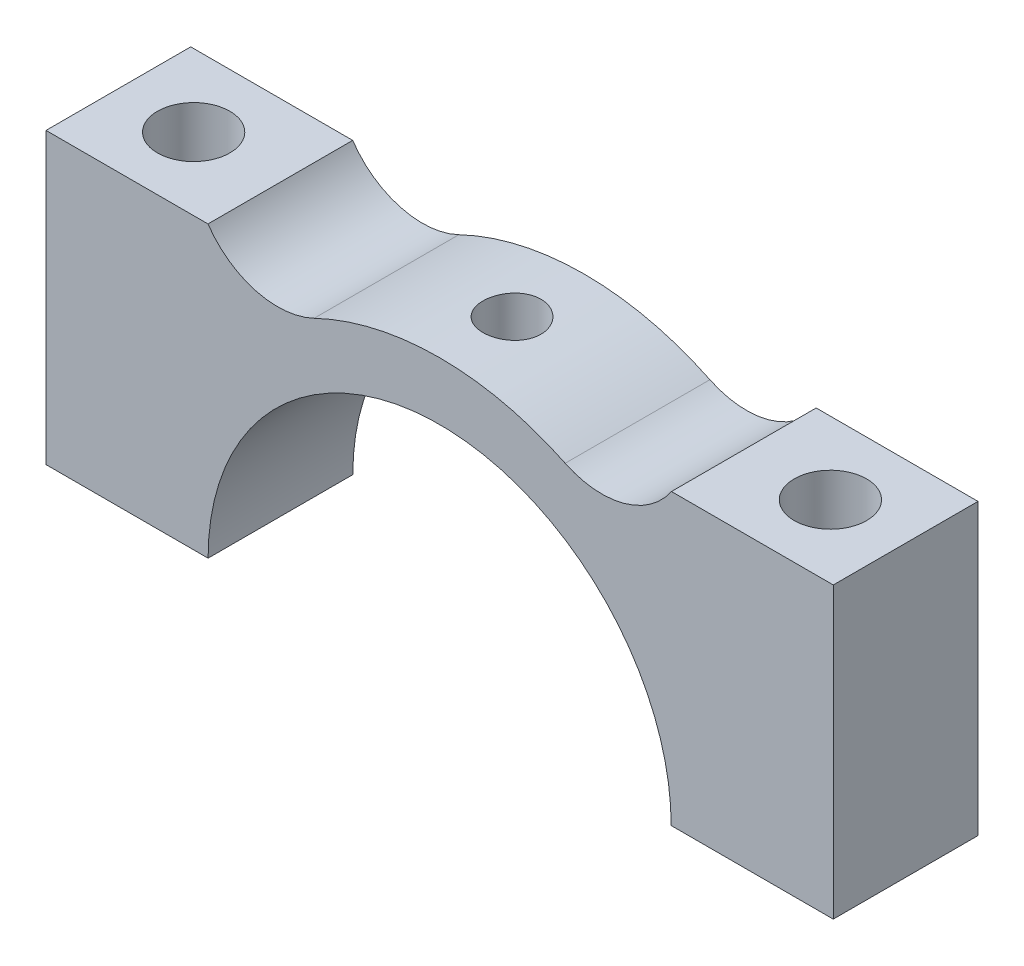
ISO-10303-21;
HEADER;
FILE_DESCRIPTION(('STEP AP214'),'2;1');
FILE_NAME('part.step','',(''),(''),'','','');
FILE_SCHEMA(('AUTOMOTIVE_DESIGN { 1 0 10303 214 1 1 1 1 }'));
ENDSEC;
DATA;
#1=APPLICATION_CONTEXT('core data for automotive mechanical design processes');
#2=APPLICATION_PROTOCOL_DEFINITION('international standard','automotive_design',2000,#1);
#3=PRODUCT_CONTEXT('',#1,'mechanical');
#4=PRODUCT('Part','Part','',(#3));
#5=PRODUCT_RELATED_PRODUCT_CATEGORY('part','',(#4));
#6=PRODUCT_DEFINITION_FORMATION('','',#4);
#7=PRODUCT_DEFINITION_CONTEXT('part definition',#1,'design');
#8=PRODUCT_DEFINITION('design','',#6,#7);
#9=PRODUCT_DEFINITION_SHAPE('','',#8);
#10=(LENGTH_UNIT() NAMED_UNIT(*) SI_UNIT(.MILLI.,.METRE.));
#11=(NAMED_UNIT(*) PLANE_ANGLE_UNIT() SI_UNIT($,.RADIAN.));
#12=(NAMED_UNIT(*) SI_UNIT($,.STERADIAN.) SOLID_ANGLE_UNIT());
#13=UNCERTAINTY_MEASURE_WITH_UNIT(LENGTH_MEASURE(1.E-05),#10,'distance_accuracy_value','');
#14=(GEOMETRIC_REPRESENTATION_CONTEXT(3) GLOBAL_UNCERTAINTY_ASSIGNED_CONTEXT((#13)) GLOBAL_UNIT_ASSIGNED_CONTEXT((#10,
#11,#12)) REPRESENTATION_CONTEXT('',''));
#15=CARTESIAN_POINT('',(0.,0.,0.));
#16=DIRECTION('',(0.,0.,1.));
#17=DIRECTION('',(1.,0.,0.));
#18=AXIS2_PLACEMENT_3D('',#15,#16,#17);
#19=CARTESIAN_POINT('',(0.,0.,5.));
#20=DIRECTION('',(0.,-1.,0.));
#21=DIRECTION('',(1.,0.,0.));
#22=AXIS2_PLACEMENT_3D('',#19,#20,#21);
#23=PLANE('',#22);
#24=CARTESIAN_POINT('',(-10.9989308914531,0.,2.49999999999886));
#25=DIRECTION('',(0.,1.,0.));
#26=DIRECTION('',(0.,0.,1.));
#27=AXIS2_PLACEMENT_3D('',#24,#25,#26);
#28=CIRCLE('',#27,1.25);
#29=CARTESIAN_POINT('',(-10.9989308914531,0.,3.74999999999886));
#30=VERTEX_POINT('',#29);
#31=EDGE_CURVE('E253',#30,#30,#28,.T.);
#32=ORIENTED_EDGE('',*,*,#31,.T.);
#33=EDGE_LOOP('',(#32));
#34=FACE_BOUND('',#33,.T.);
#35=DIRECTION('',(-1.,0.,0.));
#36=VECTOR('',#35,1.);
#37=CARTESIAN_POINT('',(0.,0.,0.));
#38=LINE('',#37,#36);
#39=CARTESIAN_POINT('',(-8.,0.,0.));
#40=VERTEX_POINT('',#39);
#41=CARTESIAN_POINT('',(-13.6,0.,0.));
#42=VERTEX_POINT('',#41);
#43=EDGE_CURVE('E169',#40,#42,#38,.T.);
#44=ORIENTED_EDGE('',*,*,#43,.F.);
#45=DIRECTION('',(0.,0.,-1.));
#46=VECTOR('',#45,1.);
#47=CARTESIAN_POINT('',(-8.,0.,5.));
#48=LINE('',#47,#46);
#49=CARTESIAN_POINT('',(-8.,0.,5.));
#50=VERTEX_POINT('',#49);
#51=EDGE_CURVE('E66',#50,#40,#48,.T.);
#52=ORIENTED_EDGE('',*,*,#51,.F.);
#53=DIRECTION('',(-1.,0.,0.));
#54=VECTOR('',#53,1.);
#55=CARTESIAN_POINT('',(0.,0.,5.));
#56=LINE('',#55,#54);
#57=CARTESIAN_POINT('',(-13.6,0.,5.));
#58=VERTEX_POINT('',#57);
#59=EDGE_CURVE('E191',#50,#58,#56,.T.);
#60=ORIENTED_EDGE('',*,*,#59,.T.);
#61=DIRECTION('',(0.,0.,-1.));
#62=VECTOR('',#61,1.);
#63=CARTESIAN_POINT('',(-13.6,0.,5.));
#64=LINE('',#63,#62);
#65=EDGE_CURVE('E74',#58,#42,#64,.T.);
#66=ORIENTED_EDGE('',*,*,#65,.T.);
#67=EDGE_LOOP('',(#44,#52,#60,#66));
#68=FACE_BOUND('',#67,.T.);
#69=ADVANCED_FACE('F53',(#34,#68),#23,.T.);
#70=CARTESIAN_POINT('',(0.,0.,5.));
#71=DIRECTION('',(0.,0.,-1.));
#72=DIRECTION('',(-1.,0.,0.));
#73=AXIS2_PLACEMENT_3D('',#70,#71,#72);
#74=CYLINDRICAL_SURFACE('',#73,8.);
#75=CARTESIAN_POINT('',(0.,8.,3.49999999999884));
#76=CARTESIAN_POINT('',(-0.0559364382223045,7.99999921958571,3.49999762362455));
#77=CARTESIAN_POINT('',(-0.111907829721099,7.99940713821961,3.49529084833112));
#78=CARTESIAN_POINT('',(-0.222293120835901,7.99710216044544,3.47658889817052));
#79=CARTESIAN_POINT('',(-0.276705332249498,7.99538809376571,3.46258402482948));
#80=CARTESIAN_POINT('',(-0.382358229925221,7.99103224417762,3.4257049424332));
#81=CARTESIAN_POINT('',(-0.433601024058455,7.98839108582217,3.40283670327489));
#82=CARTESIAN_POINT('',(-0.531511789957214,7.98247480351239,3.34889308641092));
#83=CARTESIAN_POINT('',(-0.578180544622548,7.97919978833646,3.31781911658655));
#84=CARTESIAN_POINT('',(-0.665885126772526,7.9723612852253,3.248163220063));
#85=CARTESIAN_POINT('',(-0.70689214597485,7.96879645876967,3.20954514826034));
#86=CARTESIAN_POINT('',(-0.781861117422997,7.961790904039,3.12597487058418));
#87=CARTESIAN_POINT('',(-0.8158227105569,7.95835018209707,3.08102234203354));
#88=CARTESIAN_POINT('',(-0.875844064513575,7.95196922247834,2.98587200897257));
#89=CARTESIAN_POINT('',(-0.901876838376428,7.94903070871164,2.93565705537166));
#90=CARTESIAN_POINT('',(-0.945129230630046,7.94400451383073,2.83152517921989));
#91=CARTESIAN_POINT('',(-0.962349183226086,7.94191680045254,2.77760839714003));
#92=CARTESIAN_POINT('',(-0.987399592009905,7.93884135841445,2.66790232176413));
#93=CARTESIAN_POINT('',(-0.99527868589268,7.93784793374698,2.61212429691716));
#94=CARTESIAN_POINT('',(-1.00157421982289,7.93705611257117,2.5000294946101));
#95=CARTESIAN_POINT('',(-0.999991040400967,7.93725766800603,2.44371273890632));
#96=CARTESIAN_POINT('',(-0.987446894579162,7.93882782147901,2.33247806909932));
#97=CARTESIAN_POINT('',(-0.976539505193879,7.94018975184131,2.27755400551873));
#98=CARTESIAN_POINT('',(-0.945740153272821,7.94391679903051,2.17032199151124));
#99=CARTESIAN_POINT('',(-0.925848008700761,7.94628193618289,2.11801409411322));
#100=CARTESIAN_POINT('',(-0.87758622396466,7.9517564634586,2.01733280039016));
#101=CARTESIAN_POINT('',(-0.849193301483055,7.95486789284578,1.96897067989924));
#102=CARTESIAN_POINT('',(-0.784752587782768,7.96148284572239,1.87767732223354));
#103=CARTESIAN_POINT('',(-0.748704446432311,7.96498638714265,1.83474633360936));
#104=CARTESIAN_POINT('',(-0.669679644301512,7.9720204395617,1.75522291570974));
#105=CARTESIAN_POINT('',(-0.626656803136005,7.97555096954756,1.71867636329244));
#106=CARTESIAN_POINT('',(-0.53506286764557,7.98221853022341,1.65331644798662));
#107=CARTESIAN_POINT('',(-0.486491760527301,7.98535556000602,1.62450310293004));
#108=CARTESIAN_POINT('',(-0.385144668545393,7.99088460887432,1.57542747181327));
#109=CARTESIAN_POINT('',(-0.332367278135087,7.99327637760615,1.55516805844635));
#110=CARTESIAN_POINT('',(-0.224123176172423,7.99704314312025,1.52381180258954));
#111=CARTESIAN_POINT('',(-0.168656590652267,7.99841818750348,1.51271453114402));
#112=CARTESIAN_POINT('',(-0.0570052655653994,7.99999038564304,1.50005703029462));
#113=CARTESIAN_POINT('',(-0.000827796079443296,8.00019534457054,1.49843360305321));
#114=CARTESIAN_POINT('',(0.110998414598998,7.99942535202172,1.50460309362122));
#115=CARTESIAN_POINT('',(0.166647167025882,7.99845042567285,1.51239581089947));
#116=CARTESIAN_POINT('',(0.275649803088608,7.99543507502677,1.53712388350859));
#117=CARTESIAN_POINT('',(0.329010628169881,7.99339816325548,1.55402910535989));
#118=CARTESIAN_POINT('',(0.432139861943362,7.98848689240079,1.596470980764));
#119=CARTESIAN_POINT('',(0.481908148586125,7.98561250488249,1.62200792739541));
#120=CARTESIAN_POINT('',(0.57672180827497,7.97932729164045,1.68114125500182));
#121=CARTESIAN_POINT('',(0.621741503977527,7.97591377617004,1.71477851592109));
#122=CARTESIAN_POINT('',(0.705518795850527,7.96894056930262,1.78909979901252));
#123=CARTESIAN_POINT('',(0.744276143334743,7.96538087210759,1.82978410089923));
#124=CARTESIAN_POINT('',(0.814652783527206,7.95849242185034,1.91732296670169));
#125=CARTESIAN_POINT('',(0.846230184227173,7.9551650988853,1.96421133852299));
#126=CARTESIAN_POINT('',(0.901061155777402,7.94914164414859,2.06266329794072));
#127=CARTESIAN_POINT('',(0.924314893491347,7.94644549972411,2.11422679178944));
#128=CARTESIAN_POINT('',(0.961770631546616,7.94199940157198,2.22043012765788));
#129=CARTESIAN_POINT('',(0.975996250982843,7.94024698073915,2.27506153201802));
#130=CARTESIAN_POINT('',(0.995067997547138,7.93787966362982,2.3859609935111));
#131=CARTESIAN_POINT('',(0.999914561014305,7.93726471443511,2.44222897438244));
#132=CARTESIAN_POINT('',(1.00008261443393,7.93724350792982,2.55438757168071));
#133=CARTESIAN_POINT('',(0.99546991907971,7.93782889900781,2.61027809933159));
#134=CARTESIAN_POINT('',(0.976989761939731,7.94012445814881,2.72048285173687));
#135=CARTESIAN_POINT('',(0.963122299162308,7.94183462633232,2.77479707632235));
#136=CARTESIAN_POINT('',(0.926546829475863,7.9461844630982,2.88029878270539));
#137=CARTESIAN_POINT('',(0.903841992388374,7.94882379837113,2.93148737800756));
#138=CARTESIAN_POINT('',(0.850242760860124,7.95473513297927,3.02933866161816));
#139=CARTESIAN_POINT('',(0.819348263803836,7.95800714024165,3.07600129320677));
#140=CARTESIAN_POINT('',(0.750002532506336,7.96484241900893,3.16381249013503));
#141=CARTESIAN_POINT('',(0.711502250309984,7.96840748833613,3.20492218438083));
#142=CARTESIAN_POINT('',(0.628140090787354,7.9754113263716,3.28012273006602));
#143=CARTESIAN_POINT('',(0.583276715656628,7.97885006510236,3.31421192430856));
#144=CARTESIAN_POINT('',(0.488266248341685,7.98522822634699,3.37451414284095));
#145=CARTESIAN_POINT('',(0.438099711838469,7.9881657003132,3.40069672235854));
#146=CARTESIAN_POINT('',(0.334073160920513,7.9931905963069,3.44422849716535));
#147=CARTESIAN_POINT('',(0.280217232348095,7.9952789414783,3.46158729054022));
#148=CARTESIAN_POINT('',(0.188402308787171,7.99786688131099,3.48282373526736));
#149=CARTESIAN_POINT('',(0.151022265406769,7.99866290358181,3.48925557679166));
#150=CARTESIAN_POINT('',(0.0757668252849745,7.99972972531675,3.49784449827613));
#151=CARTESIAN_POINT('',(0.0378914321984112,8.00000052865388,3.50000160975856));
#152=CARTESIAN_POINT('',(0.,8.,3.49999999999884));
#153=B_SPLINE_CURVE_WITH_KNOTS('',3,(#75,#76,#77,#78,#79,#80,#81,#82,#83,#84,#85,#86,#87,#88,
#89,#90,#91,#92,#93,#94,#95,#96,#97,#98,#99,#100,#101,#102,#103,#104,#105,#106,#107,#108,#109,
#110,#111,#112,#113,#114,#115,#116,#117,#118,#119,#120,#121,#122,#123,#124,#125,#126,#127,#128,
#129,#130,#131,#132,#133,#134,#135,#136,#137,#138,#139,#140,#141,#142,#143,#144,#145,#146,#147,
#148,#149,#150,#151,#152),.UNSPECIFIED.,.T.,.F.,(4,2,2,2,2,2,2,2,2,2,2,2,2,2,2,2,2,2,2,2,2,2,2,
2,2,2,2,2,2,2,2,2,2,2,2,2,2,2,4),(0.,0.167670909110499,0.335516984377371,0.503250203272708,
0.670954662364292,0.839483252807372,1.00802043120004,1.17712500127548,1.34622315798723,
1.51443690114528,1.68264387953865,1.84989078576677,2.01714108066496,2.18485370514213,
2.35257400205455,2.52145391254567,2.69033421245245,2.85927118292642,3.02820024361512,
3.19600111756768,3.36379841800771,3.53104421557358,3.69829569231579,3.86640961171369,
4.03453020550035,4.20360788603029,4.37268217688615,4.5413122971237,4.70993457204249,
4.87738760480886,5.04484065551819,5.21223369882595,5.37962883964905,5.54814095076732,
5.71669279388005,5.88588561214741,6.05489399473613,6.16847537275051,6.28205591320175),.UNSPECIFIED.);
#154=CARTESIAN_POINT('',(0.,8.,3.49999999999884));
#155=VERTEX_POINT('',#154);
#156=EDGE_CURVE('E265',#155,#155,#153,.T.);
#157=ORIENTED_EDGE('',*,*,#156,.F.);
#158=EDGE_LOOP('',(#157));
#159=FACE_BOUND('',#158,.T.);
#160=CARTESIAN_POINT('',(0.,0.,0.));
#161=DIRECTION('',(0.,0.,1.));
#162=DIRECTION('',(1.,0.,0.));
#163=AXIS2_PLACEMENT_3D('',#160,#161,#162);
#164=CIRCLE('',#163,8.);
#165=CARTESIAN_POINT('',(8.,0.,0.));
#166=VERTEX_POINT('',#165);
#167=EDGE_CURVE('E172',#166,#40,#164,.T.);
#168=ORIENTED_EDGE('',*,*,#167,.F.);
#169=DIRECTION('',(0.,0.,-1.));
#170=VECTOR('',#169,1.);
#171=CARTESIAN_POINT('',(8.,0.,5.));
#172=LINE('',#171,#170);
#173=CARTESIAN_POINT('',(8.,0.,5.));
#174=VERTEX_POINT('',#173);
#175=EDGE_CURVE('E336',#174,#166,#172,.T.);
#176=ORIENTED_EDGE('',*,*,#175,.F.);
#177=CARTESIAN_POINT('',(0.,0.,5.));
#178=DIRECTION('',(0.,0.,1.));
#179=DIRECTION('',(1.,0.,0.));
#180=AXIS2_PLACEMENT_3D('',#177,#178,#179);
#181=CIRCLE('',#180,8.);
#182=EDGE_CURVE('E184',#174,#50,#181,.T.);
#183=ORIENTED_EDGE('',*,*,#182,.T.);
#184=ORIENTED_EDGE('',*,*,#51,.T.);
#185=EDGE_LOOP('',(#168,#176,#183,#184));
#186=FACE_BOUND('',#185,.T.);
#187=ADVANCED_FACE('F274',(#159,#186),#74,.F.);
#188=CARTESIAN_POINT('',(0.,0.,5.));
#189=DIRECTION('',(0.,1.,0.));
#190=DIRECTION('',(0.,0.,1.));
#191=AXIS2_PLACEMENT_3D('',#188,#189,#190);
#192=PLANE('',#191);
#193=CARTESIAN_POINT('',(11.0010691085469,0.,2.49999999999884));
#194=DIRECTION('',(0.,1.,0.));
#195=DIRECTION('',(0.,0.,1.));
#196=AXIS2_PLACEMENT_3D('',#193,#194,#195);
#197=CIRCLE('',#196,1.25);
#198=CARTESIAN_POINT('',(11.0010691085469,0.,3.74999999999884));
#199=VERTEX_POINT('',#198);
#200=EDGE_CURVE('E262',#199,#199,#197,.T.);
#201=ORIENTED_EDGE('',*,*,#200,.T.);
#202=EDGE_LOOP('',(#201));
#203=FACE_BOUND('',#202,.T.);
#204=DIRECTION('',(1.,0.,0.));
#205=VECTOR('',#204,1.);
#206=CARTESIAN_POINT('',(0.,0.,0.));
#207=LINE('',#206,#205);
#208=CARTESIAN_POINT('',(13.6,0.,0.));
#209=VERTEX_POINT('',#208);
#210=EDGE_CURVE('E178',#166,#209,#207,.T.);
#211=ORIENTED_EDGE('',*,*,#210,.T.);
#212=DIRECTION('',(0.,0.,-1.));
#213=VECTOR('',#212,1.);
#214=CARTESIAN_POINT('',(13.6,0.,5.));
#215=LINE('',#214,#213);
#216=CARTESIAN_POINT('',(13.6,0.,5.));
#217=VERTEX_POINT('',#216);
#218=EDGE_CURVE('E343',#217,#209,#215,.T.);
#219=ORIENTED_EDGE('',*,*,#218,.F.);
#220=DIRECTION('',(1.,0.,0.));
#221=VECTOR('',#220,1.);
#222=CARTESIAN_POINT('',(0.,0.,5.));
#223=LINE('',#222,#221);
#224=EDGE_CURVE('E190',#174,#217,#223,.T.);
#225=ORIENTED_EDGE('',*,*,#224,.F.);
#226=ORIENTED_EDGE('',*,*,#175,.T.);
#227=EDGE_LOOP('',(#211,#219,#225,#226));
#228=FACE_BOUND('',#227,.T.);
#229=ADVANCED_FACE('F319',(#203,#228),#192,.F.);
#230=CARTESIAN_POINT('',(13.6,0.,5.));
#231=DIRECTION('',(-1.,0.,0.));
#232=DIRECTION('',(0.,0.,1.));
#233=AXIS2_PLACEMENT_3D('',#230,#231,#232);
#234=PLANE('',#233);
#235=DIRECTION('',(0.,1.,0.));
#236=VECTOR('',#235,1.);
#237=CARTESIAN_POINT('',(13.6,0.,0.));
#238=LINE('',#237,#236);
#239=CARTESIAN_POINT('',(13.6,10.,0.));
#240=VERTEX_POINT('',#239);
#241=EDGE_CURVE('E242',#209,#240,#238,.T.);
#242=ORIENTED_EDGE('',*,*,#241,.T.);
#243=DIRECTION('',(0.,0.,-1.));
#244=VECTOR('',#243,1.);
#245=CARTESIAN_POINT('',(13.6,10.,5.));
#246=LINE('',#245,#244);
#247=CARTESIAN_POINT('',(13.6,10.,5.));
#248=VERTEX_POINT('',#247);
#249=EDGE_CURVE('E349',#248,#240,#246,.T.);
#250=ORIENTED_EDGE('',*,*,#249,.F.);
#251=DIRECTION('',(0.,1.,0.));
#252=VECTOR('',#251,1.);
#253=CARTESIAN_POINT('',(13.6,0.,5.));
#254=LINE('',#253,#252);
#255=EDGE_CURVE('E196',#217,#248,#254,.T.);
#256=ORIENTED_EDGE('',*,*,#255,.F.);
#257=ORIENTED_EDGE('',*,*,#218,.T.);
#258=EDGE_LOOP('',(#242,#250,#256,#257));
#259=FACE_BOUND('',#258,.T.);
#260=ADVANCED_FACE('F316',(#259),#234,.F.);
#261=CARTESIAN_POINT('',(0.,10.,5.));
#262=DIRECTION('',(0.,-1.,0.));
#263=DIRECTION('',(0.,0.,-1.));
#264=AXIS2_PLACEMENT_3D('',#261,#262,#263);
#265=PLANE('',#264);
#266=CARTESIAN_POINT('',(11.0010691085469,10.,2.49999999999884));
#267=DIRECTION('',(0.,-1.,0.));
#268=DIRECTION('',(0.,0.,-1.));
#269=AXIS2_PLACEMENT_3D('',#266,#267,#268);
#270=CIRCLE('',#269,1.25);
#271=CARTESIAN_POINT('',(11.0010691085469,10.,1.24999999999884));
#272=VERTEX_POINT('',#271);
#273=EDGE_CURVE('E258',#272,#272,#270,.F.);
#274=ORIENTED_EDGE('',*,*,#273,.F.);
#275=EDGE_LOOP('',(#274));
#276=FACE_BOUND('',#275,.T.);
#277=DIRECTION('',(-1.,0.,0.));
#278=VECTOR('',#277,1.);
#279=CARTESIAN_POINT('',(0.,10.,0.));
#280=LINE('',#279,#278);
#281=CARTESIAN_POINT('',(8.00887124572743,10.,0.));
#282=VERTEX_POINT('',#281);
#283=EDGE_CURVE('E237',#240,#282,#280,.T.);
#284=ORIENTED_EDGE('',*,*,#283,.T.);
#285=DIRECTION('',(0.,0.,-1.));
#286=VECTOR('',#285,1.);
#287=CARTESIAN_POINT('',(8.00887124572743,10.,5.));
#288=LINE('',#287,#286);
#289=CARTESIAN_POINT('',(8.00887124572743,10.,5.));
#290=VERTEX_POINT('',#289);
#291=EDGE_CURVE('E353',#290,#282,#288,.T.);
#292=ORIENTED_EDGE('',*,*,#291,.F.);
#293=DIRECTION('',(-1.,0.,0.));
#294=VECTOR('',#293,1.);
#295=CARTESIAN_POINT('',(0.,10.,5.));
#296=LINE('',#295,#294);
#297=EDGE_CURVE('E199',#248,#290,#296,.T.);
#298=ORIENTED_EDGE('',*,*,#297,.F.);
#299=ORIENTED_EDGE('',*,*,#249,.T.);
#300=EDGE_LOOP('',(#284,#292,#298,#299));
#301=FACE_BOUND('',#300,.T.);
#302=ADVANCED_FACE('F312',(#276,#301),#265,.F.);
#303=CARTESIAN_POINT('',(5.59999999999348,11.6315143932289,5.));
#304=DIRECTION('',(0.,0.,-1.));
#305=DIRECTION('',(-1.,0.,0.));
#306=AXIS2_PLACEMENT_3D('',#303,#304,#305);
#307=CYLINDRICAL_SURFACE('',#306,2.9093813592991);
#308=CARTESIAN_POINT('',(5.59999999999348,11.6315143932289,0.));
#309=DIRECTION('',(0.,0.,1.));
#310=DIRECTION('',(1.,0.,0.));
#311=AXIS2_PLACEMENT_3D('',#308,#309,#310);
#312=CIRCLE('',#311,2.9093813592991);
#313=CARTESIAN_POINT('',(4.33793056702875,9.01012532630027,0.));
#314=VERTEX_POINT('',#313);
#315=EDGE_CURVE('E232',#314,#282,#312,.T.);
#316=ORIENTED_EDGE('',*,*,#315,.F.);
#317=DIRECTION('',(0.,0.,-1.));
#318=VECTOR('',#317,1.);
#319=CARTESIAN_POINT('',(4.33793056702875,9.01012532630027,5.));
#320=LINE('',#319,#318);
#321=CARTESIAN_POINT('',(4.33793056702875,9.01012532630027,5.));
#322=VERTEX_POINT('',#321);
#323=EDGE_CURVE('E356',#322,#314,#320,.T.);
#324=ORIENTED_EDGE('',*,*,#323,.F.);
#325=CARTESIAN_POINT('',(5.59999999999348,11.6315143932289,5.));
#326=DIRECTION('',(0.,0.,1.));
#327=DIRECTION('',(1.,0.,0.));
#328=AXIS2_PLACEMENT_3D('',#325,#326,#327);
#329=CIRCLE('',#328,2.9093813592991);
#330=EDGE_CURVE('E202',#322,#290,#329,.T.);
#331=ORIENTED_EDGE('',*,*,#330,.T.);
#332=ORIENTED_EDGE('',*,*,#291,.T.);
#333=EDGE_LOOP('',(#316,#324,#331,#332));
#334=FACE_BOUND('',#333,.T.);
#335=ADVANCED_FACE('F308',(#334),#307,.F.);
#336=CARTESIAN_POINT('',(0.,0.,5.));
#337=DIRECTION('',(0.,0.,-1.));
#338=DIRECTION('',(-1.,0.,0.));
#339=AXIS2_PLACEMENT_3D('',#336,#337,#338);
#340=CYLINDRICAL_SURFACE('',#339,10.);
#341=CARTESIAN_POINT('',(0.,10.,3.49999999999884));
#342=CARTESIAN_POINT('',(-0.0560203537915572,9.9999993552077,3.49999757409846));
#343=CARTESIAN_POINT('',(-0.112077745167773,9.99952425596206,3.49527673110239));
#344=CARTESIAN_POINT('',(-0.222638398496837,9.99767467594738,3.47651562970841));
#345=CARTESIAN_POINT('',(-0.277139879168828,9.99629920434026,3.46246510397425));
#346=CARTESIAN_POINT('',(-0.382971675453414,9.9928041456307,3.425457759401));
#347=CARTESIAN_POINT('',(-0.43430388461491,9.99068500800708,3.40250631948036));
#348=CARTESIAN_POINT('',(-0.532376160960407,9.98593957394306,3.34835909206719));
#349=CARTESIAN_POINT('',(-0.579117138779077,9.98331337838132,3.3171649439987));
#350=CARTESIAN_POINT('',(-0.666859550674082,9.97783744341324,3.24729730233656));
#351=CARTESIAN_POINT('',(-0.707842144834892,9.97498701573866,3.2086002005968));
#352=CARTESIAN_POINT('',(-0.782742521430984,9.96938956906262,3.12487546573581));
#353=CARTESIAN_POINT('',(-0.816659977082653,9.96664255484917,3.07984753995645));
#354=CARTESIAN_POINT('',(-0.876533970443617,9.96155591552784,2.98462146831522));
#355=CARTESIAN_POINT('',(-0.902473465454879,9.95921716710905,2.93441255590398));
#356=CARTESIAN_POINT('',(-0.94554638474276,9.95522037546525,2.83032441409386));
#357=CARTESIAN_POINT('',(-0.962680026591291,9.95356231542222,2.77644527541489));
#358=CARTESIAN_POINT('',(-0.987599041601894,9.95112084072978,2.66673819913283));
#359=CARTESIAN_POINT('',(-0.995415653003795,9.95033450398096,2.61091742314663));
#360=CARTESIAN_POINT('',(-1.00157528513536,9.94971643060525,2.49875113660306));
#361=CARTESIAN_POINT('',(-0.999918554870801,9.94988466888746,2.44240563987678));
#362=CARTESIAN_POINT('',(-0.987204280252678,9.95115406898935,2.33100469030552));
#363=CARTESIAN_POINT('',(-0.976180844124552,9.95225184590651,2.27594530067014));
#364=CARTESIAN_POINT('',(-0.945099144150586,9.95525134287419,2.16846203679774));
#365=CARTESIAN_POINT('',(-0.925040758255746,9.95715307378492,2.1160381981738));
#366=CARTESIAN_POINT('',(-0.876420893881507,9.9615500945207,2.01520641269995));
#367=CARTESIAN_POINT('',(-0.847844282719979,9.96404643908157,1.96680581050952));
#368=CARTESIAN_POINT('',(-0.783010027353227,9.96935051732879,1.87547478508695));
#369=CARTESIAN_POINT('',(-0.746752158336505,9.97215826012784,1.83254452201707));
#370=CARTESIAN_POINT('',(-0.667394112412069,9.97778385312989,1.75317460600981));
#371=CARTESIAN_POINT('',(-0.624264478851363,9.98060169332997,1.71676439811803));
#372=CARTESIAN_POINT('',(-0.532489481737112,9.98591829078518,1.65169636708845));
#373=CARTESIAN_POINT('',(-0.4838441119996,9.98841704768256,1.62303855264236));
#374=CARTESIAN_POINT('',(-0.382398105692364,9.99281475667096,1.57428997968858));
#375=CARTESIAN_POINT('',(-0.329596746389902,9.99471360414769,1.55420071518077));
#376=CARTESIAN_POINT('',(-0.221347217329931,9.99769647441408,1.52318108328708));
#377=CARTESIAN_POINT('',(-0.1658991267766,9.99878052157063,1.51225044200821));
#378=CARTESIAN_POINT('',(-0.0541850990919032,10.0000085166831,1.49989569226407));
#379=CARTESIAN_POINT('',(0.00207630210549248,10.0001564826774,1.49843095174634));
#380=CARTESIAN_POINT('',(0.1140437933157,9.99950641756797,1.5049428630476));
#381=CARTESIAN_POINT('',(0.169749890820471,9.99870839924468,1.51291938731412));
#382=CARTESIAN_POINT('',(0.278908206834675,9.99625861539194,1.53805369542041));
#383=CARTESIAN_POINT('',(0.33236484897202,9.99460861918039,1.55519245447685));
#384=CARTESIAN_POINT('',(0.435644321383782,9.99063998860609,1.59814517403611));
#385=CARTESIAN_POINT('',(0.485467070157118,9.98832133925254,1.62395932903823));
#386=CARTESIAN_POINT('',(0.580248180172143,9.98326475330422,1.68363083866275));
#387=CARTESIAN_POINT('',(0.625189659748918,9.98052543603441,1.71751488892465));
#388=CARTESIAN_POINT('',(0.708761623311878,9.9749393286952,1.79232606773976));
#389=CARTESIAN_POINT('',(0.747391948849177,9.97209253592971,1.83325337306915));
#390=CARTESIAN_POINT('',(0.817386109887146,9.96660024140755,1.92116657465784));
#391=CARTESIAN_POINT('',(0.848723278679544,9.96395550138975,1.96817375654146));
#392=CARTESIAN_POINT('',(0.903058258743828,9.9591783246089,2.06680736014552));
#393=CARTESIAN_POINT('',(0.926056184053882,9.95704588084038,2.11843371868723));
#394=CARTESIAN_POINT('',(0.963015208684475,9.95353947634049,2.22474873946463));
#395=CARTESIAN_POINT('',(0.976992174811862,9.95216418449789,2.27943184008996));
#396=CARTESIAN_POINT('',(0.995564007129463,9.95032365282877,2.39038319795961));
#397=CARTESIAN_POINT('',(1.00015914239952,9.94985838690186,2.44665140969451));
#398=CARTESIAN_POINT('',(0.999833138471256,9.94989113107562,2.55891068835554));
#399=CARTESIAN_POINT('',(0.994953889593112,9.95038490087009,2.61490188288165));
#400=CARTESIAN_POINT('',(0.975905452963653,9.95227103889546,2.72526491716713));
#401=CARTESIAN_POINT('',(0.961736254762159,9.95366340813718,2.77963675510482));
#402=CARTESIAN_POINT('',(0.924521686297503,9.95718868263187,2.88521734904669));
#403=CARTESIAN_POINT('',(0.901477544340915,9.95932148540361,2.93642654162856));
#404=CARTESIAN_POINT('',(0.847171554911043,9.96408751839359,3.03425689166987));
#405=CARTESIAN_POINT('',(0.815909753455414,9.96672074580951,3.08087807481947));
#406=CARTESIAN_POINT('',(0.745898556285331,9.97220487209698,3.16842367447077));
#407=CARTESIAN_POINT('',(0.707117948890268,9.97505664726751,3.20932307636592));
#408=CARTESIAN_POINT('',(0.623231699225109,9.98064854728783,3.28405223269849));
#409=CARTESIAN_POINT('',(0.578124544108256,9.98338864522976,3.31788029135601));
#410=CARTESIAN_POINT('',(0.482741434161289,9.98845562069162,3.37757345385346));
#411=CARTESIAN_POINT('',(0.432452749346763,9.99078144026812,3.40341829094402));
#412=CARTESIAN_POINT('',(0.32825827910055,9.99474629249896,3.4462624228227));
#413=CARTESIAN_POINT('',(0.274356649825609,9.99638609909654,3.46327169095238));
#414=CARTESIAN_POINT('',(0.183458261405704,9.99838213773734,3.48372061708364));
#415=CARTESIAN_POINT('',(0.147042552844508,9.99898600691833,3.48981704429819));
#416=CARTESIAN_POINT('',(0.0737565808173126,9.99979514950786,3.4979575260606));
#417=CARTESIAN_POINT('',(0.0368863192265576,10.0000004245602,3.5000015973207));
#418=CARTESIAN_POINT('',(0.,10.,3.49999999999884));
#419=B_SPLINE_CURVE_WITH_KNOTS('',3,(#341,#342,#343,#344,#345,#346,#347,#348,#349,#350,#351,
#352,#353,#354,#355,#356,#357,#358,#359,#360,#361,#362,#363,#364,#365,#366,#367,#368,#369,#370,
#371,#372,#373,#374,#375,#376,#377,#378,#379,#380,#381,#382,#383,#384,#385,#386,#387,#388,#389,
#390,#391,#392,#393,#394,#395,#396,#397,#398,#399,#400,#401,#402,#403,#404,#405,#406,#407,#408,
#409,#410,#411,#412,#413,#414,#415,#416,#417,#418),.UNSPECIFIED.,.T.,.F.,(4,2,2,2,2,2,2,2,2,2,2,
2,2,2,2,2,2,2,2,2,2,2,2,2,2,2,2,2,2,2,2,2,2,2,2,2,2,2,4),(0.,0.167926366268474,
0.336037842835486,0.504047885732202,0.672024537582782,0.840538568622945,1.00906039220706,
1.17793975472222,1.34681494442504,1.51512232045197,1.68342527255777,1.8511179744111,
2.01881294161634,2.18680761372895,2.35480720331125,2.52354734196207,2.69228766979772,
2.86105740693582,3.02982209675439,3.19786188607758,3.36589940519143,3.53358935294305,
3.70128306049467,3.86953940748698,4.0377999781023,4.20666643608598,4.37553058475374,
4.54409690593003,4.71265839239585,4.88047629293956,5.0482943822604,5.216089253628,
5.3838831853896,5.55238917427653,5.72093552636958,5.88990631026242,6.05868594795295,
6.16925667232348,6.27982694069027),.UNSPECIFIED.);
#420=CARTESIAN_POINT('',(0.,10.,3.49999999999884));
#421=VERTEX_POINT('',#420);
#422=EDGE_CURVE('E12',#421,#421,#419,.T.);
#423=ORIENTED_EDGE('',*,*,#422,.T.);
#424=EDGE_LOOP('',(#423));
#425=FACE_BOUND('',#424,.T.);
#426=CARTESIAN_POINT('',(0.,0.,0.));
#427=DIRECTION('',(0.,0.,1.));
#428=DIRECTION('',(1.,0.,0.));
#429=AXIS2_PLACEMENT_3D('',#426,#427,#428);
#430=CIRCLE('',#429,10.);
#431=CARTESIAN_POINT('',(-4.33579234993489,9.01115445979293,0.));
#432=VERTEX_POINT('',#431);
#433=EDGE_CURVE('E227',#314,#432,#430,.T.);
#434=ORIENTED_EDGE('',*,*,#433,.T.);
#435=DIRECTION('',(0.,0.,-1.));
#436=VECTOR('',#435,1.);
#437=CARTESIAN_POINT('',(-4.33579234993489,9.01115445979293,5.));
#438=LINE('',#437,#436);
#439=CARTESIAN_POINT('',(-4.33579234993489,9.01115445979293,5.));
#440=VERTEX_POINT('',#439);
#441=EDGE_CURVE('E147',#440,#432,#438,.T.);
#442=ORIENTED_EDGE('',*,*,#441,.F.);
#443=CARTESIAN_POINT('',(0.,0.,5.));
#444=DIRECTION('',(0.,0.,1.));
#445=DIRECTION('',(1.,0.,0.));
#446=AXIS2_PLACEMENT_3D('',#443,#444,#445);
#447=CIRCLE('',#446,10.);
#448=EDGE_CURVE('E156',#322,#440,#447,.T.);
#449=ORIENTED_EDGE('',*,*,#448,.F.);
#450=ORIENTED_EDGE('',*,*,#323,.T.);
#451=EDGE_LOOP('',(#434,#442,#449,#450));
#452=FACE_BOUND('',#451,.T.);
#453=ADVANCED_FACE('F304',(#425,#452),#340,.T.);
#454=CARTESIAN_POINT('',(-5.59660045217725,11.6315143932281,5.));
#455=DIRECTION('',(0.,0.,-1.));
#456=DIRECTION('',(-1.,0.,0.));
#457=AXIS2_PLACEMENT_3D('',#454,#455,#456);
#458=CYLINDRICAL_SURFACE('',#457,2.90790702248758);
#459=CARTESIAN_POINT('',(-5.59660045217725,11.6315143932281,0.));
#460=DIRECTION('',(0.,0.,1.));
#461=DIRECTION('',(1.,0.,0.));
#462=AXIS2_PLACEMENT_3D('',#459,#460,#461);
#463=CIRCLE('',#462,2.90790702248758);
#464=CARTESIAN_POINT('',(-8.0036908194302,10.,0.));
#465=VERTEX_POINT('',#464);
#466=EDGE_CURVE('E142',#465,#432,#463,.T.);
#467=ORIENTED_EDGE('',*,*,#466,.F.);
#468=DIRECTION('',(0.,0.,-1.));
#469=VECTOR('',#468,1.);
#470=CARTESIAN_POINT('',(-8.0036908194302,10.,5.));
#471=LINE('',#470,#469);
#472=CARTESIAN_POINT('',(-8.0036908194302,10.,5.));
#473=VERTEX_POINT('',#472);
#474=EDGE_CURVE('E137',#473,#465,#471,.T.);
#475=ORIENTED_EDGE('',*,*,#474,.F.);
#476=CARTESIAN_POINT('',(-5.59660045217725,11.6315143932281,5.));
#477=DIRECTION('',(0.,0.,1.));
#478=DIRECTION('',(1.,0.,0.));
#479=AXIS2_PLACEMENT_3D('',#476,#477,#478);
#480=CIRCLE('',#479,2.90790702248758);
#481=EDGE_CURVE('E140',#473,#440,#480,.T.);
#482=ORIENTED_EDGE('',*,*,#481,.T.);
#483=ORIENTED_EDGE('',*,*,#441,.T.);
#484=EDGE_LOOP('',(#467,#475,#482,#483));
#485=FACE_BOUND('',#484,.T.);
#486=ADVANCED_FACE('F139',(#485),#458,.F.);
#487=CARTESIAN_POINT('',(0.,10.,5.));
#488=DIRECTION('',(0.,1.,0.));
#489=DIRECTION('',(0.,0.,1.));
#490=AXIS2_PLACEMENT_3D('',#487,#488,#489);
#491=PLANE('',#490);
#492=CARTESIAN_POINT('',(-10.9989308914531,10.,2.49999999999886));
#493=DIRECTION('',(0.,1.,0.));
#494=DIRECTION('',(0.,0.,1.));
#495=AXIS2_PLACEMENT_3D('',#492,#493,#494);
#496=CIRCLE('',#495,1.25);
#497=CARTESIAN_POINT('',(-10.9989308914531,10.,3.74999999999886));
#498=VERTEX_POINT('',#497);
#499=EDGE_CURVE('E173',#498,#498,#496,.F.);
#500=ORIENTED_EDGE('',*,*,#499,.T.);
#501=EDGE_LOOP('',(#500));
#502=FACE_BOUND('',#501,.T.);
#503=DIRECTION('',(1.,0.,0.));
#504=VECTOR('',#503,1.);
#505=CARTESIAN_POINT('',(0.,10.,0.));
#506=LINE('',#505,#504);
#507=CARTESIAN_POINT('',(-13.6,10.,0.));
#508=VERTEX_POINT('',#507);
#509=EDGE_CURVE('E220',#508,#465,#506,.T.);
#510=ORIENTED_EDGE('',*,*,#509,.F.);
#511=DIRECTION('',(0.,0.,-1.));
#512=VECTOR('',#511,1.);
#513=CARTESIAN_POINT('',(-13.6,10.,5.));
#514=LINE('',#513,#512);
#515=CARTESIAN_POINT('',(-13.6,10.,5.));
#516=VERTEX_POINT('',#515);
#517=EDGE_CURVE('E106',#516,#508,#514,.T.);
#518=ORIENTED_EDGE('',*,*,#517,.F.);
#519=DIRECTION('',(1.,0.,0.));
#520=VECTOR('',#519,1.);
#521=CARTESIAN_POINT('',(0.,10.,5.));
#522=LINE('',#521,#520);
#523=EDGE_CURVE('E153',#516,#473,#522,.T.);
#524=ORIENTED_EDGE('',*,*,#523,.T.);
#525=ORIENTED_EDGE('',*,*,#474,.T.);
#526=EDGE_LOOP('',(#510,#518,#524,#525));
#527=FACE_BOUND('',#526,.T.);
#528=ADVANCED_FACE('F160',(#502,#527),#491,.T.);
#529=CARTESIAN_POINT('',(-13.6,0.,5.));
#530=DIRECTION('',(-1.,0.,0.));
#531=DIRECTION('',(0.,0.,1.));
#532=AXIS2_PLACEMENT_3D('',#529,#530,#531);
#533=PLANE('',#532);
#534=DIRECTION('',(0.,1.,0.));
#535=VECTOR('',#534,1.);
#536=CARTESIAN_POINT('',(-13.6,0.,0.));
#537=LINE('',#536,#535);
#538=EDGE_CURVE('E216',#42,#508,#537,.T.);
#539=ORIENTED_EDGE('',*,*,#538,.F.);
#540=ORIENTED_EDGE('',*,*,#65,.F.);
#541=DIRECTION('',(0.,1.,0.));
#542=VECTOR('',#541,1.);
#543=CARTESIAN_POINT('',(-13.6,0.,5.));
#544=LINE('',#543,#542);
#545=EDGE_CURVE('E162',#58,#516,#544,.T.);
#546=ORIENTED_EDGE('',*,*,#545,.T.);
#547=ORIENTED_EDGE('',*,*,#517,.T.);
#548=EDGE_LOOP('',(#539,#540,#546,#547));
#549=FACE_BOUND('',#548,.T.);
#550=ADVANCED_FACE('F294',(#549),#533,.T.);
#551=CARTESIAN_POINT('',(0.,0.,5.));
#552=DIRECTION('',(0.,0.,1.));
#553=DIRECTION('',(1.,0.,0.));
#554=AXIS2_PLACEMENT_3D('',#551,#552,#553);
#555=PLANE('',#554);
#556=ORIENTED_EDGE('',*,*,#59,.F.);
#557=ORIENTED_EDGE('',*,*,#182,.F.);
#558=ORIENTED_EDGE('',*,*,#224,.T.);
#559=ORIENTED_EDGE('',*,*,#255,.T.);
#560=ORIENTED_EDGE('',*,*,#297,.T.);
#561=ORIENTED_EDGE('',*,*,#330,.F.);
#562=ORIENTED_EDGE('',*,*,#448,.T.);
#563=ORIENTED_EDGE('',*,*,#481,.F.);
#564=ORIENTED_EDGE('',*,*,#523,.F.);
#565=ORIENTED_EDGE('',*,*,#545,.F.);
#566=EDGE_LOOP('',(#556,#557,#558,#559,#560,#561,#562,#563,#564,#565));
#567=FACE_BOUND('',#566,.T.);
#568=ADVANCED_FACE('F151',(#567),#555,.T.);
#569=CARTESIAN_POINT('',(0.,0.,0.));
#570=DIRECTION('',(0.,0.,1.));
#571=DIRECTION('',(1.,0.,0.));
#572=AXIS2_PLACEMENT_3D('',#569,#570,#571);
#573=PLANE('',#572);
#574=ORIENTED_EDGE('',*,*,#43,.T.);
#575=ORIENTED_EDGE('',*,*,#538,.T.);
#576=ORIENTED_EDGE('',*,*,#509,.T.);
#577=ORIENTED_EDGE('',*,*,#466,.T.);
#578=ORIENTED_EDGE('',*,*,#433,.F.);
#579=ORIENTED_EDGE('',*,*,#315,.T.);
#580=ORIENTED_EDGE('',*,*,#283,.F.);
#581=ORIENTED_EDGE('',*,*,#241,.F.);
#582=ORIENTED_EDGE('',*,*,#210,.F.);
#583=ORIENTED_EDGE('',*,*,#167,.T.);
#584=EDGE_LOOP('',(#574,#575,#576,#577,#578,#579,#580,#581,#582,#583));
#585=FACE_BOUND('',#584,.T.);
#586=ADVANCED_FACE('F290',(#585),#573,.F.);
#587=CARTESIAN_POINT('',(-10.9989308914531,310.,2.49999999999886));
#588=DIRECTION('',(0.,-1.,0.));
#589=DIRECTION('',(0.,0.,-1.));
#590=AXIS2_PLACEMENT_3D('',#587,#588,#589);
#591=CYLINDRICAL_SURFACE('',#590,1.25);
#592=ORIENTED_EDGE('',*,*,#499,.F.);
#593=EDGE_LOOP('',(#592));
#594=FACE_BOUND('',#593,.T.);
#595=ORIENTED_EDGE('',*,*,#31,.F.);
#596=EDGE_LOOP('',(#595));
#597=FACE_BOUND('',#596,.T.);
#598=ADVANCED_FACE('F286',(#594,#597),#591,.F.);
#599=CARTESIAN_POINT('',(11.0010691085469,310.,2.49999999999884));
#600=DIRECTION('',(0.,-1.,0.));
#601=DIRECTION('',(0.,0.,-1.));
#602=AXIS2_PLACEMENT_3D('',#599,#600,#601);
#603=CYLINDRICAL_SURFACE('',#602,1.25);
#604=ORIENTED_EDGE('',*,*,#200,.F.);
#605=EDGE_LOOP('',(#604));
#606=FACE_BOUND('',#605,.T.);
#607=ORIENTED_EDGE('',*,*,#273,.T.);
#608=EDGE_LOOP('',(#607));
#609=FACE_BOUND('',#608,.T.);
#610=ADVANCED_FACE('F281',(#606,#609),#603,.F.);
#611=CARTESIAN_POINT('',(0.,0.,2.49999999999884));
#612=DIRECTION('',(0.,1.,0.));
#613=DIRECTION('',(0.,0.,1.));
#614=AXIS2_PLACEMENT_3D('',#611,#612,#613);
#615=CYLINDRICAL_SURFACE('',#614,1.);
#616=ORIENTED_EDGE('',*,*,#156,.T.);
#617=EDGE_LOOP('',(#616));
#618=FACE_BOUND('',#617,.T.);
#619=ORIENTED_EDGE('',*,*,#422,.F.);
#620=EDGE_LOOP('',(#619));
#621=FACE_BOUND('',#620,.T.);
#622=ADVANCED_FACE('F277',(#618,#621),#615,.F.);
#623=CLOSED_SHELL('',(#69,#187,#229,#260,#302,#335,#453,#486,#528,#550,#568,#586,#598,#610,#622));
#624=MANIFOLD_SOLID_BREP('B2',#623);
#625=ADVANCED_BREP_SHAPE_REPRESENTATION('',(#18,#624),#14);
#626=SHAPE_DEFINITION_REPRESENTATION(#9,#625);
ENDSEC;
END-ISO-10303-21;
